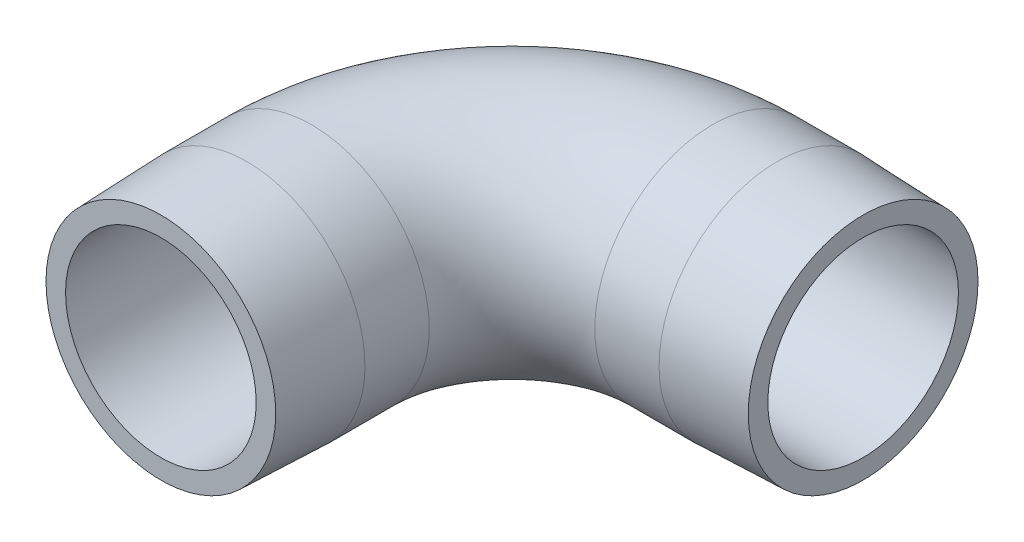
ISO-10303-21;
HEADER;
FILE_DESCRIPTION(('STEP AP214'),'2;1');
FILE_NAME('part.step','',(''),(''),'','','');
FILE_SCHEMA(('AUTOMOTIVE_DESIGN { 1 0 10303 214 1 1 1 1 }'));
ENDSEC;
DATA;
#1=APPLICATION_CONTEXT('core data for automotive mechanical design processes');
#2=APPLICATION_PROTOCOL_DEFINITION('international standard','automotive_design',2000,#1);
#3=PRODUCT_CONTEXT('',#1,'mechanical');
#4=PRODUCT('Part','Part','',(#3));
#5=PRODUCT_RELATED_PRODUCT_CATEGORY('part','',(#4));
#6=PRODUCT_DEFINITION_FORMATION('','',#4);
#7=PRODUCT_DEFINITION_CONTEXT('part definition',#1,'design');
#8=PRODUCT_DEFINITION('design','',#6,#7);
#9=PRODUCT_DEFINITION_SHAPE('','',#8);
#10=(LENGTH_UNIT() NAMED_UNIT(*) SI_UNIT(.MILLI.,.METRE.));
#11=(NAMED_UNIT(*) PLANE_ANGLE_UNIT() SI_UNIT($,.RADIAN.));
#12=(NAMED_UNIT(*) SI_UNIT($,.STERADIAN.) SOLID_ANGLE_UNIT());
#13=UNCERTAINTY_MEASURE_WITH_UNIT(LENGTH_MEASURE(1.E-05),#10,'distance_accuracy_value','');
#14=(GEOMETRIC_REPRESENTATION_CONTEXT(3) GLOBAL_UNCERTAINTY_ASSIGNED_CONTEXT((#13)) GLOBAL_UNIT_ASSIGNED_CONTEXT((#10,
#11,#12)) REPRESENTATION_CONTEXT('',''));
#15=CARTESIAN_POINT('',(0.,0.,0.));
#16=DIRECTION('',(0.,0.,1.));
#17=DIRECTION('',(1.,0.,0.));
#18=AXIS2_PLACEMENT_3D('',#15,#16,#17);
#19=CARTESIAN_POINT('',(20.,0.,-35.));
#20=DIRECTION('',(1.,0.,0.));
#21=DIRECTION('',(0.,0.,-1.));
#22=AXIS2_PLACEMENT_3D('',#19,#20,#21);
#23=CYLINDRICAL_SURFACE('',#22,11.75);
#24=CARTESIAN_POINT('',(20.,0.,-35.));
#25=DIRECTION('',(-1.,0.,0.));
#26=DIRECTION('',(0.,0.,1.));
#27=AXIS2_PLACEMENT_3D('',#24,#25,#26);
#28=CIRCLE('',#27,11.75);
#29=CARTESIAN_POINT('',(20.,0.,-46.75));
#30=VERTEX_POINT('',#29);
#31=EDGE_CURVE('E42',#30,#30,#28,.T.);
#32=ORIENTED_EDGE('',*,*,#31,.F.);
#33=EDGE_LOOP('',(#32));
#34=FACE_BOUND('',#33,.T.);
#35=CARTESIAN_POINT('',(26.4091240151253,0.,-35.));
#36=DIRECTION('',(-1.,0.,0.));
#37=DIRECTION('',(0.,0.,1.));
#38=AXIS2_PLACEMENT_3D('',#35,#36,#37);
#39=CIRCLE('',#38,11.75);
#40=CARTESIAN_POINT('',(26.4091240151253,0.,-23.25));
#41=VERTEX_POINT('',#40);
#42=EDGE_CURVE('E73',#41,#41,#39,.F.);
#43=ORIENTED_EDGE('',*,*,#42,.F.);
#44=EDGE_LOOP('',(#43));
#45=FACE_BOUND('',#44,.T.);
#46=ADVANCED_FACE('F39',(#34,#45),#23,.T.);
#47=CARTESIAN_POINT('',(35.,0.,-35.));
#48=DIRECTION('',(-1.,0.,0.));
#49=DIRECTION('',(0.,0.,1.));
#50=AXIS2_PLACEMENT_3D('',#47,#48,#49);
#51=PLANE('',#50);
#52=CARTESIAN_POINT('',(35.,0.,-35.));
#53=DIRECTION('',(-1.,0.,0.));
#54=DIRECTION('',(0.,0.,1.));
#55=AXIS2_PLACEMENT_3D('',#52,#53,#54);
#56=CIRCLE('',#55,9.5);
#57=CARTESIAN_POINT('',(35.,0.,-25.5));
#58=VERTEX_POINT('',#57);
#59=EDGE_CURVE('E11',#58,#58,#56,.F.);
#60=ORIENTED_EDGE('',*,*,#59,.F.);
#61=EDGE_LOOP('',(#60));
#62=FACE_BOUND('',#61,.T.);
#63=CARTESIAN_POINT('',(35.,0.,-35.));
#64=DIRECTION('',(1.,0.,0.));
#65=DIRECTION('',(0.,0.,-1.));
#66=AXIS2_PLACEMENT_3D('',#63,#64,#65);
#67=CIRCLE('',#66,11.45);
#68=CARTESIAN_POINT('',(35.,0.,-46.45));
#69=VERTEX_POINT('',#68);
#70=EDGE_CURVE('E115',#69,#69,#67,.T.);
#71=ORIENTED_EDGE('',*,*,#70,.T.);
#72=EDGE_LOOP('',(#71));
#73=FACE_BOUND('',#72,.T.);
#74=ADVANCED_FACE('F101',(#62,#73),#51,.F.);
#75=CARTESIAN_POINT('',(0.,0.,0.));
#76=DIRECTION('',(0.,0.,-1.));
#77=DIRECTION('',(-1.,0.,0.));
#78=AXIS2_PLACEMENT_3D('',#75,#76,#77);
#79=CYLINDRICAL_SURFACE('',#78,11.75);
#80=CARTESIAN_POINT('',(0.,0.,-15.));
#81=DIRECTION('',(0.,0.,1.));
#82=DIRECTION('',(1.,0.,0.));
#83=AXIS2_PLACEMENT_3D('',#80,#81,#82);
#84=CIRCLE('',#83,11.75);
#85=CARTESIAN_POINT('',(-11.75,0.,-15.));
#86=VERTEX_POINT('',#85);
#87=EDGE_CURVE('E56',#86,#86,#84,.T.);
#88=ORIENTED_EDGE('',*,*,#87,.T.);
#89=EDGE_LOOP('',(#88));
#90=FACE_BOUND('',#89,.T.);
#91=CARTESIAN_POINT('',(0.,0.,-8.59087598487466));
#92=DIRECTION('',(0.,0.,-1.));
#93=DIRECTION('',(-1.,0.,0.));
#94=AXIS2_PLACEMENT_3D('',#91,#92,#93);
#95=CIRCLE('',#94,11.75);
#96=CARTESIAN_POINT('',(-11.75,0.,-8.59087598487466));
#97=VERTEX_POINT('',#96);
#98=EDGE_CURVE('E59',#97,#97,#95,.F.);
#99=ORIENTED_EDGE('',*,*,#98,.F.);
#100=EDGE_LOOP('',(#99));
#101=FACE_BOUND('',#100,.T.);
#102=ADVANCED_FACE('F106',(#90,#101),#79,.T.);
#103=CARTESIAN_POINT('',(0.,0.,0.));
#104=DIRECTION('',(0.,0.,1.));
#105=DIRECTION('',(1.,0.,0.));
#106=AXIS2_PLACEMENT_3D('',#103,#104,#105);
#107=PLANE('',#106);
#108=CARTESIAN_POINT('',(0.,0.,0.));
#109=DIRECTION('',(0.,0.,1.));
#110=DIRECTION('',(1.,0.,0.));
#111=AXIS2_PLACEMENT_3D('',#108,#109,#110);
#112=CIRCLE('',#111,9.5);
#113=CARTESIAN_POINT('',(9.5,0.,0.));
#114=VERTEX_POINT('',#113);
#115=EDGE_CURVE('E65',#114,#114,#112,.F.);
#116=ORIENTED_EDGE('',*,*,#115,.T.);
#117=EDGE_LOOP('',(#116));
#118=FACE_BOUND('',#117,.T.);
#119=CARTESIAN_POINT('',(0.,0.,0.));
#120=DIRECTION('',(0.,0.,1.));
#121=DIRECTION('',(1.,0.,0.));
#122=AXIS2_PLACEMENT_3D('',#119,#120,#121);
#123=CIRCLE('',#122,11.45);
#124=CARTESIAN_POINT('',(11.45,0.,0.));
#125=VERTEX_POINT('',#124);
#126=EDGE_CURVE('E67',#125,#125,#123,.T.);
#127=ORIENTED_EDGE('',*,*,#126,.T.);
#128=EDGE_LOOP('',(#127));
#129=FACE_BOUND('',#128,.T.);
#130=ADVANCED_FACE('F97',(#118,#129),#107,.T.);
#131=CARTESIAN_POINT('',(20.,0.,-15.));
#132=DIRECTION('',(0.,-1.,0.));
#133=DIRECTION('',(0.,0.,-1.));
#134=AXIS2_PLACEMENT_3D('',#131,#132,#133);
#135=TOROIDAL_SURFACE('',#134,20.,11.75);
#136=CARTESIAN_POINT('',(20.,0.,-15.));
#137=DIRECTION('',(0.,-1.,0.));
#138=DIRECTION('',(0.,0.,-1.));
#139=AXIS2_PLACEMENT_3D('',#136,#137,#138);
#140=CIRCLE('',#139,31.75);
#141=EDGE_CURVE('',#86,#30,#140,.T.);
#142=ORIENTED_EDGE('',*,*,#87,.F.);
#143=ORIENTED_EDGE('',*,*,#31,.T.);
#144=ORIENTED_EDGE('',*,*,#141,.T.);
#145=ORIENTED_EDGE('',*,*,#141,.F.);
#146=EDGE_LOOP('',(#142,#144,#143,#145));
#147=FACE_BOUND('',#146,.T.);
#148=ADVANCED_FACE('F98',(#147),#135,.T.);
#149=CARTESIAN_POINT('',(0.,0.,0.));
#150=DIRECTION('',(0.,0.,-1.));
#151=DIRECTION('',(-1.,0.,0.));
#152=AXIS2_PLACEMENT_3D('',#149,#150,#151);
#153=CYLINDRICAL_SURFACE('',#152,9.5);
#154=CARTESIAN_POINT('',(0.,0.,-15.));
#155=DIRECTION('',(0.,0.,1.));
#156=DIRECTION('',(1.,0.,0.));
#157=AXIS2_PLACEMENT_3D('',#154,#155,#156);
#158=CIRCLE('',#157,9.5);
#159=CARTESIAN_POINT('',(-9.5,0.,-15.));
#160=VERTEX_POINT('',#159);
#161=EDGE_CURVE('E53',#160,#160,#158,.F.);
#162=ORIENTED_EDGE('',*,*,#161,.T.);
#163=EDGE_LOOP('',(#162));
#164=FACE_BOUND('',#163,.T.);
#165=ORIENTED_EDGE('',*,*,#115,.F.);
#166=EDGE_LOOP('',(#165));
#167=FACE_BOUND('',#166,.T.);
#168=ADVANCED_FACE('F83',(#164,#167),#153,.F.);
#169=CARTESIAN_POINT('',(20.,0.,-15.));
#170=DIRECTION('',(0.,-1.,0.));
#171=DIRECTION('',(0.,0.,-1.));
#172=AXIS2_PLACEMENT_3D('',#169,#170,#171);
#173=TOROIDAL_SURFACE('',#172,20.,9.5);
#174=CARTESIAN_POINT('',(20.,0.,-35.));
#175=DIRECTION('',(-1.,0.,0.));
#176=DIRECTION('',(0.,0.,1.));
#177=AXIS2_PLACEMENT_3D('',#174,#175,#176);
#178=CIRCLE('',#177,9.5);
#179=CARTESIAN_POINT('',(20.,0.,-44.5));
#180=VERTEX_POINT('',#179);
#181=EDGE_CURVE('E47',#180,#180,#178,.F.);
#182=CARTESIAN_POINT('',(20.,0.,-15.));
#183=DIRECTION('',(0.,-1.,0.));
#184=DIRECTION('',(0.,0.,-1.));
#185=AXIS2_PLACEMENT_3D('',#182,#183,#184);
#186=CIRCLE('',#185,29.5);
#187=EDGE_CURVE('',#160,#180,#186,.T.);
#188=ORIENTED_EDGE('',*,*,#161,.F.);
#189=ORIENTED_EDGE('',*,*,#181,.T.);
#190=ORIENTED_EDGE('',*,*,#187,.T.);
#191=ORIENTED_EDGE('',*,*,#187,.F.);
#192=EDGE_LOOP('',(#188,#190,#189,#191));
#193=FACE_BOUND('',#192,.T.);
#194=ADVANCED_FACE('F86',(#193),#173,.F.);
#195=CARTESIAN_POINT('',(20.,0.,-35.));
#196=DIRECTION('',(1.,0.,0.));
#197=DIRECTION('',(0.,0.,-1.));
#198=AXIS2_PLACEMENT_3D('',#195,#196,#197);
#199=CYLINDRICAL_SURFACE('',#198,9.5);
#200=ORIENTED_EDGE('',*,*,#59,.T.);
#201=EDGE_LOOP('',(#200));
#202=FACE_BOUND('',#201,.T.);
#203=ORIENTED_EDGE('',*,*,#181,.F.);
#204=EDGE_LOOP('',(#203));
#205=FACE_BOUND('',#204,.T.);
#206=ADVANCED_FACE('F88',(#202,#205),#199,.F.);
#207=CARTESIAN_POINT('',(0.,0.,0.));
#208=DIRECTION('',(0.,0.,-1.));
#209=DIRECTION('',(1.,0.,0.));
#210=AXIS2_PLACEMENT_3D('',#207,#208,#209);
#211=CONICAL_SURFACE('',#210,11.45,0.0349065850398867);
#212=ORIENTED_EDGE('',*,*,#126,.F.);
#213=EDGE_LOOP('',(#212));
#214=FACE_BOUND('',#213,.T.);
#215=ORIENTED_EDGE('',*,*,#98,.T.);
#216=EDGE_LOOP('',(#215));
#217=FACE_BOUND('',#216,.T.);
#218=ADVANCED_FACE('F95',(#214,#217),#211,.T.);
#219=CARTESIAN_POINT('',(35.,0.,-35.));
#220=DIRECTION('',(-1.,0.,0.));
#221=DIRECTION('',(0.,0.,-1.));
#222=AXIS2_PLACEMENT_3D('',#219,#220,#221);
#223=CONICAL_SURFACE('',#222,11.45,0.0349065850398867);
#224=ORIENTED_EDGE('',*,*,#70,.F.);
#225=EDGE_LOOP('',(#224));
#226=FACE_BOUND('',#225,.T.);
#227=ORIENTED_EDGE('',*,*,#42,.T.);
#228=EDGE_LOOP('',(#227));
#229=FACE_BOUND('',#228,.T.);
#230=ADVANCED_FACE('F122',(#226,#229),#223,.T.);
#231=CLOSED_SHELL('',(#46,#74,#102,#130,#148,#168,#194,#206,#218,#230));
#232=MANIFOLD_SOLID_BREP('B2',#231);
#233=ADVANCED_BREP_SHAPE_REPRESENTATION('',(#18,#232),#14);
#234=SHAPE_DEFINITION_REPRESENTATION(#9,#233);
ENDSEC;
END-ISO-10303-21;
